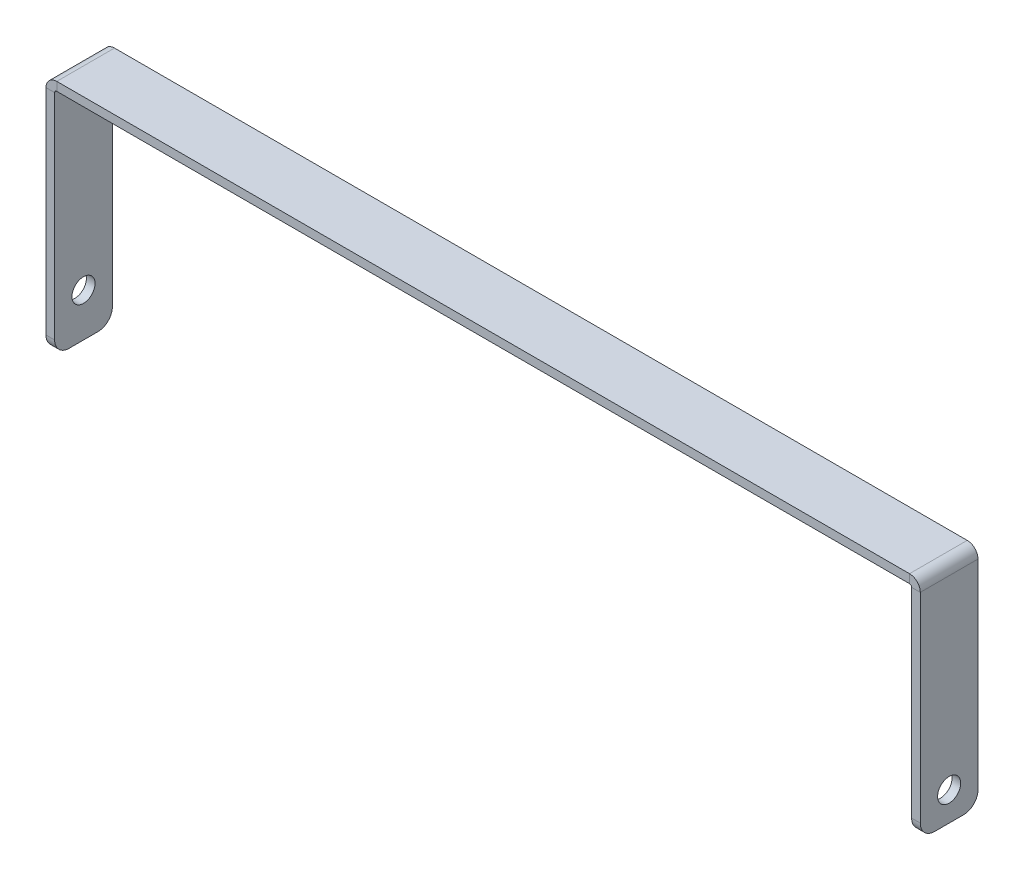
ISO-10303-21;
HEADER;
FILE_DESCRIPTION(('STEP AP214'),'2;1');
FILE_NAME('part.step','',(''),(''),'','','');
FILE_SCHEMA(('AUTOMOTIVE_DESIGN { 1 0 10303 214 1 1 1 1 }'));
ENDSEC;
DATA;
#1=APPLICATION_CONTEXT('core data for automotive mechanical design processes');
#2=APPLICATION_PROTOCOL_DEFINITION('international standard','automotive_design',2000,#1);
#3=PRODUCT_CONTEXT('',#1,'mechanical');
#4=PRODUCT('Part','Part','',(#3));
#5=PRODUCT_RELATED_PRODUCT_CATEGORY('part','',(#4));
#6=PRODUCT_DEFINITION_FORMATION('','',#4);
#7=PRODUCT_DEFINITION_CONTEXT('part definition',#1,'design');
#8=PRODUCT_DEFINITION('design','',#6,#7);
#9=PRODUCT_DEFINITION_SHAPE('','',#8);
#10=(LENGTH_UNIT() NAMED_UNIT(*) SI_UNIT(.MILLI.,.METRE.));
#11=(NAMED_UNIT(*) PLANE_ANGLE_UNIT() SI_UNIT($,.RADIAN.));
#12=(NAMED_UNIT(*) SI_UNIT($,.STERADIAN.) SOLID_ANGLE_UNIT());
#13=UNCERTAINTY_MEASURE_WITH_UNIT(LENGTH_MEASURE(1.E-05),#10,'distance_accuracy_value','');
#14=(GEOMETRIC_REPRESENTATION_CONTEXT(3) GLOBAL_UNCERTAINTY_ASSIGNED_CONTEXT((#13)) GLOBAL_UNIT_ASSIGNED_CONTEXT((#10,
#11,#12)) REPRESENTATION_CONTEXT('',''));
#15=CARTESIAN_POINT('',(0.,0.,0.));
#16=DIRECTION('',(0.,0.,1.));
#17=DIRECTION('',(1.,0.,0.));
#18=AXIS2_PLACEMENT_3D('',#15,#16,#17);
#19=CARTESIAN_POINT('',(-148.5,36.7634,10.));
#20=DIRECTION('',(0.,0.,1.));
#21=DIRECTION('',(1.,0.,0.));
#22=AXIS2_PLACEMENT_3D('',#19,#20,#21);
#23=PLANE('',#22);
#24=DIRECTION('',(-1.,0.,0.));
#25=VECTOR('',#24,1.);
#26=CARTESIAN_POINT('',(-148.5,36.7634,10.));
#27=LINE('',#26,#25);
#28=CARTESIAN_POINT('',(-148.5,36.7634,10.));
#29=VERTEX_POINT('',#28);
#30=CARTESIAN_POINT('',(-151.5,36.7634,10.));
#31=VERTEX_POINT('',#30);
#32=EDGE_CURVE('E273',#29,#31,#27,.T.);
#33=ORIENTED_EDGE('',*,*,#32,.F.);
#34=CARTESIAN_POINT('',(-147.7634,36.7634,10.));
#35=DIRECTION('',(0.,0.,1.));
#36=DIRECTION('',(1.,0.,0.));
#37=AXIS2_PLACEMENT_3D('',#34,#35,#36);
#38=CIRCLE('',#37,0.7366);
#39=CARTESIAN_POINT('',(-147.7634,37.5,10.));
#40=VERTEX_POINT('',#39);
#41=EDGE_CURVE('E202',#29,#40,#38,.F.);
#42=ORIENTED_EDGE('',*,*,#41,.T.);
#43=DIRECTION('',(0.,-1.,0.));
#44=VECTOR('',#43,1.);
#45=CARTESIAN_POINT('',(-147.7634,40.5,10.));
#46=LINE('',#45,#44);
#47=CARTESIAN_POINT('',(-147.7634,40.5,10.));
#48=VERTEX_POINT('',#47);
#49=EDGE_CURVE('E271',#48,#40,#46,.T.);
#50=ORIENTED_EDGE('',*,*,#49,.F.);
#51=CARTESIAN_POINT('',(-147.7634,36.7634,10.));
#52=DIRECTION('',(0.,0.,1.));
#53=DIRECTION('',(1.,0.,0.));
#54=AXIS2_PLACEMENT_3D('',#51,#52,#53);
#55=CIRCLE('',#54,3.7366);
#56=EDGE_CURVE('E192',#31,#48,#55,.F.);
#57=ORIENTED_EDGE('',*,*,#56,.F.);
#58=EDGE_LOOP('',(#33,#42,#50,#57));
#59=FACE_BOUND('',#58,.T.);
#60=ADVANCED_FACE('F36',(#59),#23,.T.);
#61=CARTESIAN_POINT('',(-147.7634,40.5,10.));
#62=DIRECTION('',(0.,0.,1.));
#63=DIRECTION('',(1.,0.,0.));
#64=AXIS2_PLACEMENT_3D('',#61,#62,#63);
#65=PLANE('',#64);
#66=DIRECTION('',(0.,1.,0.));
#67=VECTOR('',#66,1.);
#68=CARTESIAN_POINT('',(-151.5,-42.5,10.));
#69=LINE('',#68,#67);
#70=CARTESIAN_POINT('',(-151.5,-37.5,10.));
#71=VERTEX_POINT('',#70);
#72=EDGE_CURVE('E198',#71,#31,#69,.T.);
#73=ORIENTED_EDGE('',*,*,#72,.F.);
#74=DIRECTION('',(-1.,0.,0.));
#75=VECTOR('',#74,1.);
#76=CARTESIAN_POINT('',(-147.7634,-37.5,10.));
#77=LINE('',#76,#75);
#78=CARTESIAN_POINT('',(-148.5,-37.5,10.));
#79=VERTEX_POINT('',#78);
#80=EDGE_CURVE('E11',#71,#79,#77,.F.);
#81=ORIENTED_EDGE('',*,*,#80,.T.);
#82=DIRECTION('',(0.,1.,0.));
#83=VECTOR('',#82,1.);
#84=CARTESIAN_POINT('',(-148.5,-42.5,10.));
#85=LINE('',#84,#83);
#86=EDGE_CURVE('E200',#79,#29,#85,.T.);
#87=ORIENTED_EDGE('',*,*,#86,.T.);
#88=ORIENTED_EDGE('',*,*,#32,.T.);
#89=EDGE_LOOP('',(#73,#81,#87,#88));
#90=FACE_BOUND('',#89,.T.);
#91=ADVANCED_FACE('F328',(#90),#65,.T.);
#92=CARTESIAN_POINT('',(-147.7634,37.5,-10.));
#93=DIRECTION('',(0.,0.,-1.));
#94=DIRECTION('',(-1.,0.,0.));
#95=AXIS2_PLACEMENT_3D('',#92,#93,#94);
#96=PLANE('',#95);
#97=DIRECTION('',(0.,1.,0.));
#98=VECTOR('',#97,1.);
#99=CARTESIAN_POINT('',(-147.7634,37.5,-10.));
#100=LINE('',#99,#98);
#101=CARTESIAN_POINT('',(-147.7634,37.5,-10.));
#102=VERTEX_POINT('',#101);
#103=CARTESIAN_POINT('',(-147.7634,40.5,-10.));
#104=VERTEX_POINT('',#103);
#105=EDGE_CURVE('E269',#102,#104,#100,.T.);
#106=ORIENTED_EDGE('',*,*,#105,.F.);
#107=CARTESIAN_POINT('',(-147.7634,36.7634,-10.));
#108=DIRECTION('',(0.,0.,1.));
#109=DIRECTION('',(1.,0.,0.));
#110=AXIS2_PLACEMENT_3D('',#107,#108,#109);
#111=CIRCLE('',#110,0.7366);
#112=CARTESIAN_POINT('',(-148.5,36.7634,-10.));
#113=VERTEX_POINT('',#112);
#114=EDGE_CURVE('E227',#113,#102,#111,.F.);
#115=ORIENTED_EDGE('',*,*,#114,.F.);
#116=DIRECTION('',(1.,0.,0.));
#117=VECTOR('',#116,1.);
#118=CARTESIAN_POINT('',(-151.5,36.7634,-10.));
#119=LINE('',#118,#117);
#120=CARTESIAN_POINT('',(-151.5,36.7634,-10.));
#121=VERTEX_POINT('',#120);
#122=EDGE_CURVE('E266',#121,#113,#119,.T.);
#123=ORIENTED_EDGE('',*,*,#122,.F.);
#124=CARTESIAN_POINT('',(-147.7634,36.7634,-10.));
#125=DIRECTION('',(0.,0.,1.));
#126=DIRECTION('',(1.,0.,0.));
#127=AXIS2_PLACEMENT_3D('',#124,#125,#126);
#128=CIRCLE('',#127,3.7366);
#129=EDGE_CURVE('E220',#121,#104,#128,.F.);
#130=ORIENTED_EDGE('',*,*,#129,.T.);
#131=EDGE_LOOP('',(#106,#115,#123,#130));
#132=FACE_BOUND('',#131,.T.);
#133=ADVANCED_FACE('F390',(#132),#96,.T.);
#134=CARTESIAN_POINT('',(-151.5,36.7634,-10.));
#135=DIRECTION('',(0.,0.,-1.));
#136=DIRECTION('',(-1.,0.,0.));
#137=AXIS2_PLACEMENT_3D('',#134,#135,#136);
#138=PLANE('',#137);
#139=DIRECTION('',(1.,0.,0.));
#140=VECTOR('',#139,1.);
#141=CARTESIAN_POINT('',(-148.5,37.5,-10.));
#142=LINE('',#141,#140);
#143=CARTESIAN_POINT('',(147.7634,37.5,-10.));
#144=VERTEX_POINT('',#143);
#145=EDGE_CURVE('E230',#102,#144,#142,.T.);
#146=ORIENTED_EDGE('',*,*,#145,.F.);
#147=ORIENTED_EDGE('',*,*,#105,.T.);
#148=DIRECTION('',(1.,0.,0.));
#149=VECTOR('',#148,1.);
#150=CARTESIAN_POINT('',(-148.5,40.5,-10.));
#151=LINE('',#150,#149);
#152=CARTESIAN_POINT('',(147.7634,40.5,-10.));
#153=VERTEX_POINT('',#152);
#154=EDGE_CURVE('E217',#104,#153,#151,.T.);
#155=ORIENTED_EDGE('',*,*,#154,.T.);
#156=DIRECTION('',(0.,-1.,0.));
#157=VECTOR('',#156,1.);
#158=CARTESIAN_POINT('',(147.7634,40.5,-10.));
#159=LINE('',#158,#157);
#160=EDGE_CURVE('E262',#153,#144,#159,.T.);
#161=ORIENTED_EDGE('',*,*,#160,.T.);
#162=EDGE_LOOP('',(#146,#147,#155,#161));
#163=FACE_BOUND('',#162,.T.);
#164=ADVANCED_FACE('F611',(#163),#138,.T.);
#165=CARTESIAN_POINT('',(147.7634,37.5,10.));
#166=DIRECTION('',(0.,0.,1.));
#167=DIRECTION('',(1.,0.,0.));
#168=AXIS2_PLACEMENT_3D('',#165,#166,#167);
#169=PLANE('',#168);
#170=DIRECTION('',(0.,1.,0.));
#171=VECTOR('',#170,1.);
#172=CARTESIAN_POINT('',(147.7634,37.5,10.));
#173=LINE('',#172,#171);
#174=CARTESIAN_POINT('',(147.7634,37.5,10.));
#175=VERTEX_POINT('',#174);
#176=CARTESIAN_POINT('',(147.7634,40.5,10.));
#177=VERTEX_POINT('',#176);
#178=EDGE_CURVE('E162',#175,#177,#173,.T.);
#179=ORIENTED_EDGE('',*,*,#178,.F.);
#180=CARTESIAN_POINT('',(147.7634,36.7634,10.));
#181=DIRECTION('',(0.,0.,1.));
#182=DIRECTION('',(1.,0.,0.));
#183=AXIS2_PLACEMENT_3D('',#180,#181,#182);
#184=CIRCLE('',#183,0.7366);
#185=CARTESIAN_POINT('',(148.5,36.7634,10.));
#186=VERTEX_POINT('',#185);
#187=EDGE_CURVE('E157',#175,#186,#184,.F.);
#188=ORIENTED_EDGE('',*,*,#187,.T.);
#189=DIRECTION('',(-1.,0.,0.));
#190=VECTOR('',#189,1.);
#191=CARTESIAN_POINT('',(151.5,36.7634,10.));
#192=LINE('',#191,#190);
#193=CARTESIAN_POINT('',(151.5,36.7634,10.));
#194=VERTEX_POINT('',#193);
#195=EDGE_CURVE('E150',#194,#186,#192,.T.);
#196=ORIENTED_EDGE('',*,*,#195,.F.);
#197=CARTESIAN_POINT('',(147.7634,36.7634,10.));
#198=DIRECTION('',(0.,0.,1.));
#199=DIRECTION('',(1.,0.,0.));
#200=AXIS2_PLACEMENT_3D('',#197,#198,#199);
#201=CIRCLE('',#200,3.7366);
#202=EDGE_CURVE('E154',#177,#194,#201,.F.);
#203=ORIENTED_EDGE('',*,*,#202,.F.);
#204=EDGE_LOOP('',(#179,#188,#196,#203));
#205=FACE_BOUND('',#204,.T.);
#206=ADVANCED_FACE('F152',(#205),#169,.T.);
#207=CARTESIAN_POINT('',(151.5,36.7634,10.));
#208=DIRECTION('',(0.,0.,1.));
#209=DIRECTION('',(1.,0.,0.));
#210=AXIS2_PLACEMENT_3D('',#207,#208,#209);
#211=PLANE('',#210);
#212=DIRECTION('',(1.,0.,0.));
#213=VECTOR('',#212,1.);
#214=CARTESIAN_POINT('',(-148.5,37.5,10.));
#215=LINE('',#214,#213);
#216=EDGE_CURVE('E205',#40,#175,#215,.T.);
#217=ORIENTED_EDGE('',*,*,#216,.T.);
#218=ORIENTED_EDGE('',*,*,#178,.T.);
#219=DIRECTION('',(1.,0.,0.));
#220=VECTOR('',#219,1.);
#221=CARTESIAN_POINT('',(-148.5,40.5,10.));
#222=LINE('',#221,#220);
#223=EDGE_CURVE('E190',#48,#177,#222,.T.);
#224=ORIENTED_EDGE('',*,*,#223,.F.);
#225=ORIENTED_EDGE('',*,*,#49,.T.);
#226=EDGE_LOOP('',(#217,#218,#224,#225));
#227=FACE_BOUND('',#226,.T.);
#228=ADVANCED_FACE('F344',(#227),#211,.T.);
#229=CARTESIAN_POINT('',(148.5,36.7634,-10.));
#230=DIRECTION('',(0.,0.,-1.));
#231=DIRECTION('',(-1.,0.,0.));
#232=AXIS2_PLACEMENT_3D('',#229,#230,#231);
#233=PLANE('',#232);
#234=DIRECTION('',(1.,0.,0.));
#235=VECTOR('',#234,1.);
#236=CARTESIAN_POINT('',(148.5,36.7634,-10.));
#237=LINE('',#236,#235);
#238=CARTESIAN_POINT('',(148.5,36.7634,-10.));
#239=VERTEX_POINT('',#238);
#240=CARTESIAN_POINT('',(151.5,36.7634,-10.));
#241=VERTEX_POINT('',#240);
#242=EDGE_CURVE('E163',#239,#241,#237,.T.);
#243=ORIENTED_EDGE('',*,*,#242,.F.);
#244=CARTESIAN_POINT('',(147.7634,36.7634,-10.));
#245=DIRECTION('',(0.,0.,1.));
#246=DIRECTION('',(1.,0.,0.));
#247=AXIS2_PLACEMENT_3D('',#244,#245,#246);
#248=CIRCLE('',#247,0.7366);
#249=EDGE_CURVE('E233',#144,#239,#248,.F.);
#250=ORIENTED_EDGE('',*,*,#249,.F.);
#251=ORIENTED_EDGE('',*,*,#160,.F.);
#252=CARTESIAN_POINT('',(147.7634,36.7634,-10.));
#253=DIRECTION('',(0.,0.,1.));
#254=DIRECTION('',(1.,0.,0.));
#255=AXIS2_PLACEMENT_3D('',#252,#253,#254);
#256=CIRCLE('',#255,3.7366);
#257=EDGE_CURVE('E215',#153,#241,#256,.F.);
#258=ORIENTED_EDGE('',*,*,#257,.T.);
#259=EDGE_LOOP('',(#243,#250,#251,#258));
#260=FACE_BOUND('',#259,.T.);
#261=ADVANCED_FACE('F513',(#260),#233,.T.);
#262=CARTESIAN_POINT('',(147.7634,40.5,-10.));
#263=DIRECTION('',(0.,0.,-1.));
#264=DIRECTION('',(-1.,0.,0.));
#265=AXIS2_PLACEMENT_3D('',#262,#263,#264);
#266=PLANE('',#265);
#267=DIRECTION('',(0.,-1.,0.));
#268=VECTOR('',#267,1.);
#269=CARTESIAN_POINT('',(151.5,37.5,-10.));
#270=LINE('',#269,#268);
#271=CARTESIAN_POINT('',(151.5,-32.5,-10.));
#272=VERTEX_POINT('',#271);
#273=EDGE_CURVE('E175',#241,#272,#270,.T.);
#274=ORIENTED_EDGE('',*,*,#273,.T.);
#275=DIRECTION('',(-1.,0.,0.));
#276=VECTOR('',#275,1.);
#277=CARTESIAN_POINT('',(147.7634,-32.5,-10.));
#278=LINE('',#277,#276);
#279=CARTESIAN_POINT('',(148.5,-32.5,-10.));
#280=VERTEX_POINT('',#279);
#281=EDGE_CURVE('E276',#272,#280,#278,.T.);
#282=ORIENTED_EDGE('',*,*,#281,.T.);
#283=DIRECTION('',(0.,-1.,0.));
#284=VECTOR('',#283,1.);
#285=CARTESIAN_POINT('',(148.5,37.5,-10.));
#286=LINE('',#285,#284);
#287=EDGE_CURVE('E210',#239,#280,#286,.T.);
#288=ORIENTED_EDGE('',*,*,#287,.F.);
#289=ORIENTED_EDGE('',*,*,#242,.T.);
#290=EDGE_LOOP('',(#274,#282,#288,#289));
#291=FACE_BOUND('',#290,.T.);
#292=ADVANCED_FACE('F502',(#291),#266,.T.);
#293=CARTESIAN_POINT('',(148.5,37.5,10.));
#294=DIRECTION('',(1.,0.,0.));
#295=DIRECTION('',(0.,1.,0.));
#296=AXIS2_PLACEMENT_3D('',#293,#294,#295);
#297=PLANE('',#296);
#298=CARTESIAN_POINT('',(148.5,-27.5000000000001,0.));
#299=DIRECTION('',(1.,0.,0.));
#300=DIRECTION('',(0.,1.,0.));
#301=AXIS2_PLACEMENT_3D('',#298,#299,#300);
#302=CIRCLE('',#301,4.);
#303=CARTESIAN_POINT('',(148.5,-23.5000000000001,0.));
#304=VERTEX_POINT('',#303);
#305=EDGE_CURVE('E213',#304,#304,#302,.T.);
#306=ORIENTED_EDGE('',*,*,#305,.T.);
#307=EDGE_LOOP('',(#306));
#308=FACE_BOUND('',#307,.T.);
#309=ORIENTED_EDGE('',*,*,#287,.T.);
#310=CARTESIAN_POINT('',(148.5,-32.5,-5.));
#311=DIRECTION('',(1.,0.,0.));
#312=DIRECTION('',(0.,1.,0.));
#313=AXIS2_PLACEMENT_3D('',#310,#311,#312);
#314=CIRCLE('',#313,5.);
#315=CARTESIAN_POINT('',(148.5,-37.5,-5.));
#316=VERTEX_POINT('',#315);
#317=EDGE_CURVE('E285',#280,#316,#314,.F.);
#318=ORIENTED_EDGE('',*,*,#317,.T.);
#319=DIRECTION('',(0.,0.,-1.));
#320=VECTOR('',#319,1.);
#321=CARTESIAN_POINT('',(148.5,-37.5,10.));
#322=LINE('',#321,#320);
#323=CARTESIAN_POINT('',(148.5,-37.5,5.));
#324=VERTEX_POINT('',#323);
#325=EDGE_CURVE('E259',#324,#316,#322,.T.);
#326=ORIENTED_EDGE('',*,*,#325,.F.);
#327=CARTESIAN_POINT('',(148.5,-32.5,5.));
#328=DIRECTION('',(1.,0.,0.));
#329=DIRECTION('',(0.,1.,0.));
#330=AXIS2_PLACEMENT_3D('',#327,#328,#329);
#331=CIRCLE('',#330,5.);
#332=CARTESIAN_POINT('',(148.5,-32.5,10.));
#333=VERTEX_POINT('',#332);
#334=EDGE_CURVE('E283',#324,#333,#331,.F.);
#335=ORIENTED_EDGE('',*,*,#334,.T.);
#336=DIRECTION('',(0.,-1.,0.));
#337=VECTOR('',#336,1.);
#338=CARTESIAN_POINT('',(148.5,37.5,10.));
#339=LINE('',#338,#337);
#340=EDGE_CURVE('E185',#186,#333,#339,.T.);
#341=ORIENTED_EDGE('',*,*,#340,.F.);
#342=DIRECTION('',(0.,0.,-1.));
#343=VECTOR('',#342,1.);
#344=CARTESIAN_POINT('',(148.5,36.7634,10.));
#345=LINE('',#344,#343);
#346=EDGE_CURVE('E209',#186,#239,#345,.T.);
#347=ORIENTED_EDGE('',*,*,#346,.T.);
#348=EDGE_LOOP('',(#309,#318,#326,#335,#341,#347));
#349=FACE_BOUND('',#348,.T.);
#350=ADVANCED_FACE('F356',(#308,#349),#297,.F.);
#351=CARTESIAN_POINT('',(151.5,-37.5,10.));
#352=DIRECTION('',(0.,-1.,0.));
#353=DIRECTION('',(0.,0.,-1.));
#354=AXIS2_PLACEMENT_3D('',#351,#352,#353);
#355=PLANE('',#354);
#356=ORIENTED_EDGE('',*,*,#325,.T.);
#357=DIRECTION('',(-1.,0.,0.));
#358=VECTOR('',#357,1.);
#359=CARTESIAN_POINT('',(151.5,-37.5,-5.));
#360=LINE('',#359,#358);
#361=CARTESIAN_POINT('',(151.5,-37.5,-5.));
#362=VERTEX_POINT('',#361);
#363=EDGE_CURVE('E290',#316,#362,#360,.F.);
#364=ORIENTED_EDGE('',*,*,#363,.T.);
#365=DIRECTION('',(0.,0.,-1.));
#366=VECTOR('',#365,1.);
#367=CARTESIAN_POINT('',(151.5,-37.5,10.));
#368=LINE('',#367,#366);
#369=CARTESIAN_POINT('',(151.5,-37.5,5.));
#370=VERTEX_POINT('',#369);
#371=EDGE_CURVE('E179',#370,#362,#368,.T.);
#372=ORIENTED_EDGE('',*,*,#371,.F.);
#373=DIRECTION('',(-1.,0.,0.));
#374=VECTOR('',#373,1.);
#375=CARTESIAN_POINT('',(151.5,-37.5,5.));
#376=LINE('',#375,#374);
#377=EDGE_CURVE('E287',#370,#324,#376,.T.);
#378=ORIENTED_EDGE('',*,*,#377,.T.);
#379=EDGE_LOOP('',(#356,#364,#372,#378));
#380=FACE_BOUND('',#379,.T.);
#381=ADVANCED_FACE('F479',(#380),#355,.T.);
#382=CARTESIAN_POINT('',(151.5,37.5,10.));
#383=DIRECTION('',(1.,0.,0.));
#384=DIRECTION('',(0.,1.,0.));
#385=AXIS2_PLACEMENT_3D('',#382,#383,#384);
#386=PLANE('',#385);
#387=CARTESIAN_POINT('',(151.5,-27.5000000000001,0.));
#388=DIRECTION('',(1.,0.,0.));
#389=DIRECTION('',(0.,1.,0.));
#390=AXIS2_PLACEMENT_3D('',#387,#388,#389);
#391=CIRCLE('',#390,4.);
#392=CARTESIAN_POINT('',(151.5,-23.5000000000001,0.));
#393=VERTEX_POINT('',#392);
#394=EDGE_CURVE('E361',#393,#393,#391,.T.);
#395=ORIENTED_EDGE('',*,*,#394,.F.);
#396=EDGE_LOOP('',(#395));
#397=FACE_BOUND('',#396,.T.);
#398=ORIENTED_EDGE('',*,*,#371,.T.);
#399=CARTESIAN_POINT('',(151.5,-32.5,-5.));
#400=DIRECTION('',(1.,0.,0.));
#401=DIRECTION('',(0.,1.,0.));
#402=AXIS2_PLACEMENT_3D('',#399,#400,#401);
#403=CIRCLE('',#402,5.);
#404=EDGE_CURVE('E294',#362,#272,#403,.T.);
#405=ORIENTED_EDGE('',*,*,#404,.T.);
#406=ORIENTED_EDGE('',*,*,#273,.F.);
#407=DIRECTION('',(0.,0.,-1.));
#408=VECTOR('',#407,1.);
#409=CARTESIAN_POINT('',(151.5,36.7634,10.));
#410=LINE('',#409,#408);
#411=EDGE_CURVE('E169',#194,#241,#410,.T.);
#412=ORIENTED_EDGE('',*,*,#411,.F.);
#413=DIRECTION('',(0.,-1.,0.));
#414=VECTOR('',#413,1.);
#415=CARTESIAN_POINT('',(151.5,37.5,10.));
#416=LINE('',#415,#414);
#417=CARTESIAN_POINT('',(151.5,-32.5,10.));
#418=VERTEX_POINT('',#417);
#419=EDGE_CURVE('E172',#194,#418,#416,.T.);
#420=ORIENTED_EDGE('',*,*,#419,.T.);
#421=CARTESIAN_POINT('',(151.5,-32.5,5.));
#422=DIRECTION('',(1.,0.,0.));
#423=DIRECTION('',(0.,1.,0.));
#424=AXIS2_PLACEMENT_3D('',#421,#422,#423);
#425=CIRCLE('',#424,5.);
#426=EDGE_CURVE('E292',#418,#370,#425,.T.);
#427=ORIENTED_EDGE('',*,*,#426,.T.);
#428=EDGE_LOOP('',(#398,#405,#406,#412,#420,#427));
#429=FACE_BOUND('',#428,.T.);
#430=ADVANCED_FACE('F171',(#397,#429),#386,.T.);
#431=CARTESIAN_POINT('',(147.7634,36.7634,10.));
#432=DIRECTION('',(0.,0.,-1.));
#433=DIRECTION('',(-1.,0.,0.));
#434=AXIS2_PLACEMENT_3D('',#431,#432,#433);
#435=CYLINDRICAL_SURFACE('',#434,3.7366);
#436=ORIENTED_EDGE('',*,*,#257,.F.);
#437=DIRECTION('',(0.,0.,-1.));
#438=VECTOR('',#437,1.);
#439=CARTESIAN_POINT('',(147.7634,40.5,10.));
#440=LINE('',#439,#438);
#441=EDGE_CURVE('E180',#177,#153,#440,.T.);
#442=ORIENTED_EDGE('',*,*,#441,.F.);
#443=ORIENTED_EDGE('',*,*,#202,.T.);
#444=ORIENTED_EDGE('',*,*,#411,.T.);
#445=EDGE_LOOP('',(#436,#442,#443,#444));
#446=FACE_BOUND('',#445,.T.);
#447=ADVANCED_FACE('F188',(#446),#435,.T.);
#448=CARTESIAN_POINT('',(-148.5,40.5,10.));
#449=DIRECTION('',(0.,1.,0.));
#450=DIRECTION('',(0.,0.,1.));
#451=AXIS2_PLACEMENT_3D('',#448,#449,#450);
#452=PLANE('',#451);
#453=ORIENTED_EDGE('',*,*,#154,.F.);
#454=DIRECTION('',(0.,0.,-1.));
#455=VECTOR('',#454,1.);
#456=CARTESIAN_POINT('',(-147.7634,40.5,10.));
#457=LINE('',#456,#455);
#458=EDGE_CURVE('E254',#48,#104,#457,.T.);
#459=ORIENTED_EDGE('',*,*,#458,.F.);
#460=ORIENTED_EDGE('',*,*,#223,.T.);
#461=ORIENTED_EDGE('',*,*,#441,.T.);
#462=EDGE_LOOP('',(#453,#459,#460,#461));
#463=FACE_BOUND('',#462,.T.);
#464=ADVANCED_FACE('F343',(#463),#452,.T.);
#465=CARTESIAN_POINT('',(-147.7634,36.7634,10.));
#466=DIRECTION('',(0.,0.,-1.));
#467=DIRECTION('',(-1.,0.,0.));
#468=AXIS2_PLACEMENT_3D('',#465,#466,#467);
#469=CYLINDRICAL_SURFACE('',#468,3.7366);
#470=ORIENTED_EDGE('',*,*,#129,.F.);
#471=DIRECTION('',(0.,0.,-1.));
#472=VECTOR('',#471,1.);
#473=CARTESIAN_POINT('',(-151.5,36.7634,10.));
#474=LINE('',#473,#472);
#475=EDGE_CURVE('E251',#31,#121,#474,.T.);
#476=ORIENTED_EDGE('',*,*,#475,.F.);
#477=ORIENTED_EDGE('',*,*,#56,.T.);
#478=ORIENTED_EDGE('',*,*,#458,.T.);
#479=EDGE_LOOP('',(#470,#476,#477,#478));
#480=FACE_BOUND('',#479,.T.);
#481=ADVANCED_FACE('F335',(#480),#469,.T.);
#482=CARTESIAN_POINT('',(-151.5,-42.5,10.));
#483=DIRECTION('',(-1.,0.,0.));
#484=DIRECTION('',(0.,0.,1.));
#485=AXIS2_PLACEMENT_3D('',#482,#483,#484);
#486=PLANE('',#485);
#487=CARTESIAN_POINT('',(-151.5,-27.5000000000002,0.));
#488=DIRECTION('',(1.,0.,0.));
#489=DIRECTION('',(0.,1.,0.));
#490=AXIS2_PLACEMENT_3D('',#487,#488,#489);
#491=CIRCLE('',#490,4.);
#492=CARTESIAN_POINT('',(-151.5,-23.5000000000002,0.));
#493=VERTEX_POINT('',#492);
#494=EDGE_CURVE('E280',#493,#493,#491,.T.);
#495=ORIENTED_EDGE('',*,*,#494,.T.);
#496=EDGE_LOOP('',(#495));
#497=FACE_BOUND('',#496,.T.);
#498=DIRECTION('',(0.,1.,0.));
#499=VECTOR('',#498,1.);
#500=CARTESIAN_POINT('',(-151.5,-42.5,-10.));
#501=LINE('',#500,#499);
#502=CARTESIAN_POINT('',(-151.5,-37.5,-10.));
#503=VERTEX_POINT('',#502);
#504=EDGE_CURVE('E223',#503,#121,#501,.T.);
#505=ORIENTED_EDGE('',*,*,#504,.F.);
#506=CARTESIAN_POINT('',(-151.5,-37.5,-5.));
#507=DIRECTION('',(-1.,0.,0.));
#508=DIRECTION('',(0.,0.,1.));
#509=AXIS2_PLACEMENT_3D('',#506,#507,#508);
#510=CIRCLE('',#509,5.);
#511=CARTESIAN_POINT('',(-151.5,-42.5,-5.));
#512=VERTEX_POINT('',#511);
#513=EDGE_CURVE('E302',#503,#512,#510,.T.);
#514=ORIENTED_EDGE('',*,*,#513,.T.);
#515=DIRECTION('',(0.,0.,-1.));
#516=VECTOR('',#515,1.);
#517=CARTESIAN_POINT('',(-151.5,-42.5,10.));
#518=LINE('',#517,#516);
#519=CARTESIAN_POINT('',(-151.5,-42.5,5.));
#520=VERTEX_POINT('',#519);
#521=EDGE_CURVE('E249',#520,#512,#518,.T.);
#522=ORIENTED_EDGE('',*,*,#521,.F.);
#523=CARTESIAN_POINT('',(-151.5,-37.5,5.));
#524=DIRECTION('',(-1.,0.,0.));
#525=DIRECTION('',(0.,0.,1.));
#526=AXIS2_PLACEMENT_3D('',#523,#524,#525);
#527=CIRCLE('',#526,5.);
#528=EDGE_CURVE('E300',#520,#71,#527,.T.);
#529=ORIENTED_EDGE('',*,*,#528,.T.);
#530=ORIENTED_EDGE('',*,*,#72,.T.);
#531=ORIENTED_EDGE('',*,*,#475,.T.);
#532=EDGE_LOOP('',(#505,#514,#522,#529,#530,#531));
#533=FACE_BOUND('',#532,.T.);
#534=ADVANCED_FACE('F323',(#497,#533),#486,.T.);
#535=CARTESIAN_POINT('',(-148.5,-42.5,10.));
#536=DIRECTION('',(0.,-1.,0.));
#537=DIRECTION('',(0.,0.,-1.));
#538=AXIS2_PLACEMENT_3D('',#535,#536,#537);
#539=PLANE('',#538);
#540=ORIENTED_EDGE('',*,*,#521,.T.);
#541=DIRECTION('',(-1.,0.,0.));
#542=VECTOR('',#541,1.);
#543=CARTESIAN_POINT('',(-148.5,-42.5,-5.));
#544=LINE('',#543,#542);
#545=CARTESIAN_POINT('',(-148.5,-42.5,-5.));
#546=VERTEX_POINT('',#545);
#547=EDGE_CURVE('E57',#512,#546,#544,.F.);
#548=ORIENTED_EDGE('',*,*,#547,.T.);
#549=DIRECTION('',(0.,0.,-1.));
#550=VECTOR('',#549,1.);
#551=CARTESIAN_POINT('',(-148.5,-42.5,10.));
#552=LINE('',#551,#550);
#553=CARTESIAN_POINT('',(-148.5,-42.5,5.));
#554=VERTEX_POINT('',#553);
#555=EDGE_CURVE('E247',#554,#546,#552,.T.);
#556=ORIENTED_EDGE('',*,*,#555,.F.);
#557=DIRECTION('',(-1.,0.,0.));
#558=VECTOR('',#557,1.);
#559=CARTESIAN_POINT('',(-148.5,-42.5,5.));
#560=LINE('',#559,#558);
#561=EDGE_CURVE('E304',#554,#520,#560,.T.);
#562=ORIENTED_EDGE('',*,*,#561,.T.);
#563=EDGE_LOOP('',(#540,#548,#556,#562));
#564=FACE_BOUND('',#563,.T.);
#565=ADVANCED_FACE('F324',(#564),#539,.T.);
#566=CARTESIAN_POINT('',(-148.5,-42.5,10.));
#567=DIRECTION('',(-1.,0.,0.));
#568=DIRECTION('',(0.,0.,1.));
#569=AXIS2_PLACEMENT_3D('',#566,#567,#568);
#570=PLANE('',#569);
#571=CARTESIAN_POINT('',(-148.5,-27.5000000000002,0.));
#572=DIRECTION('',(-1.,0.,0.));
#573=DIRECTION('',(0.,0.,1.));
#574=AXIS2_PLACEMENT_3D('',#571,#572,#573);
#575=CIRCLE('',#574,4.);
#576=CARTESIAN_POINT('',(-148.5,-27.5000000000002,4.));
#577=VERTEX_POINT('',#576);
#578=EDGE_CURVE('E277',#577,#577,#575,.T.);
#579=ORIENTED_EDGE('',*,*,#578,.T.);
#580=EDGE_LOOP('',(#579));
#581=FACE_BOUND('',#580,.T.);
#582=ORIENTED_EDGE('',*,*,#555,.T.);
#583=CARTESIAN_POINT('',(-148.5,-37.5,-5.));
#584=DIRECTION('',(-1.,0.,0.));
#585=DIRECTION('',(0.,0.,1.));
#586=AXIS2_PLACEMENT_3D('',#583,#584,#585);
#587=CIRCLE('',#586,5.);
#588=CARTESIAN_POINT('',(-148.5,-37.5,-10.));
#589=VERTEX_POINT('',#588);
#590=EDGE_CURVE('E44',#546,#589,#587,.F.);
#591=ORIENTED_EDGE('',*,*,#590,.T.);
#592=DIRECTION('',(0.,1.,0.));
#593=VECTOR('',#592,1.);
#594=CARTESIAN_POINT('',(-148.5,-42.5,-10.));
#595=LINE('',#594,#593);
#596=EDGE_CURVE('E225',#589,#113,#595,.T.);
#597=ORIENTED_EDGE('',*,*,#596,.T.);
#598=DIRECTION('',(0.,0.,-1.));
#599=VECTOR('',#598,1.);
#600=CARTESIAN_POINT('',(-148.5,36.7634,10.));
#601=LINE('',#600,#599);
#602=EDGE_CURVE('E244',#29,#113,#601,.T.);
#603=ORIENTED_EDGE('',*,*,#602,.F.);
#604=ORIENTED_EDGE('',*,*,#86,.F.);
#605=CARTESIAN_POINT('',(-148.5,-37.5,5.));
#606=DIRECTION('',(-1.,0.,0.));
#607=DIRECTION('',(0.,0.,1.));
#608=AXIS2_PLACEMENT_3D('',#605,#606,#607);
#609=CIRCLE('',#608,5.);
#610=EDGE_CURVE('E308',#79,#554,#609,.F.);
#611=ORIENTED_EDGE('',*,*,#610,.T.);
#612=EDGE_LOOP('',(#582,#591,#597,#603,#604,#611));
#613=FACE_BOUND('',#612,.T.);
#614=ADVANCED_FACE('F312',(#581,#613),#570,.F.);
#615=CARTESIAN_POINT('',(-147.7634,36.7634,10.));
#616=DIRECTION('',(0.,0.,-1.));
#617=DIRECTION('',(-1.,0.,0.));
#618=AXIS2_PLACEMENT_3D('',#615,#616,#617);
#619=CYLINDRICAL_SURFACE('',#618,0.7366);
#620=ORIENTED_EDGE('',*,*,#114,.T.);
#621=DIRECTION('',(0.,0.,-1.));
#622=VECTOR('',#621,1.);
#623=CARTESIAN_POINT('',(-147.7634,37.5,10.));
#624=LINE('',#623,#622);
#625=EDGE_CURVE('E241',#40,#102,#624,.T.);
#626=ORIENTED_EDGE('',*,*,#625,.F.);
#627=ORIENTED_EDGE('',*,*,#41,.F.);
#628=ORIENTED_EDGE('',*,*,#602,.T.);
#629=EDGE_LOOP('',(#620,#626,#627,#628));
#630=FACE_BOUND('',#629,.T.);
#631=ADVANCED_FACE('F376',(#630),#619,.F.);
#632=CARTESIAN_POINT('',(-148.5,37.5,10.));
#633=DIRECTION('',(0.,1.,0.));
#634=DIRECTION('',(0.,0.,1.));
#635=AXIS2_PLACEMENT_3D('',#632,#633,#634);
#636=PLANE('',#635);
#637=ORIENTED_EDGE('',*,*,#145,.T.);
#638=DIRECTION('',(0.,0.,-1.));
#639=VECTOR('',#638,1.);
#640=CARTESIAN_POINT('',(147.7634,37.5,10.));
#641=LINE('',#640,#639);
#642=EDGE_CURVE('E238',#175,#144,#641,.T.);
#643=ORIENTED_EDGE('',*,*,#642,.F.);
#644=ORIENTED_EDGE('',*,*,#216,.F.);
#645=ORIENTED_EDGE('',*,*,#625,.T.);
#646=EDGE_LOOP('',(#637,#643,#644,#645));
#647=FACE_BOUND('',#646,.T.);
#648=ADVANCED_FACE('F348',(#647),#636,.F.);
#649=CARTESIAN_POINT('',(147.7634,36.7634,10.));
#650=DIRECTION('',(0.,0.,-1.));
#651=DIRECTION('',(-1.,0.,0.));
#652=AXIS2_PLACEMENT_3D('',#649,#650,#651);
#653=CYLINDRICAL_SURFACE('',#652,0.7366);
#654=ORIENTED_EDGE('',*,*,#249,.T.);
#655=ORIENTED_EDGE('',*,*,#346,.F.);
#656=ORIENTED_EDGE('',*,*,#187,.F.);
#657=ORIENTED_EDGE('',*,*,#642,.T.);
#658=EDGE_LOOP('',(#654,#655,#656,#657));
#659=FACE_BOUND('',#658,.T.);
#660=ADVANCED_FACE('F352',(#659),#653,.F.);
#661=CARTESIAN_POINT('',(147.7634,36.7634,10.));
#662=DIRECTION('',(0.,0.,1.));
#663=DIRECTION('',(1.,0.,0.));
#664=AXIS2_PLACEMENT_3D('',#661,#662,#663);
#665=PLANE('',#664);
#666=ORIENTED_EDGE('',*,*,#340,.T.);
#667=DIRECTION('',(-1.,0.,0.));
#668=VECTOR('',#667,1.);
#669=CARTESIAN_POINT('',(147.7634,-32.5,10.));
#670=LINE('',#669,#668);
#671=EDGE_CURVE('E184',#333,#418,#670,.F.);
#672=ORIENTED_EDGE('',*,*,#671,.T.);
#673=ORIENTED_EDGE('',*,*,#419,.F.);
#674=ORIENTED_EDGE('',*,*,#195,.T.);
#675=EDGE_LOOP('',(#666,#672,#673,#674));
#676=FACE_BOUND('',#675,.T.);
#677=ADVANCED_FACE('F182',(#676),#665,.T.);
#678=CARTESIAN_POINT('',(147.7634,36.7634,-10.));
#679=DIRECTION('',(0.,0.,1.));
#680=DIRECTION('',(1.,0.,0.));
#681=AXIS2_PLACEMENT_3D('',#678,#679,#680);
#682=PLANE('',#681);
#683=ORIENTED_EDGE('',*,*,#596,.F.);
#684=DIRECTION('',(-1.,0.,0.));
#685=VECTOR('',#684,1.);
#686=CARTESIAN_POINT('',(-151.5,-37.5,-10.));
#687=LINE('',#686,#685);
#688=EDGE_CURVE('E297',#589,#503,#687,.T.);
#689=ORIENTED_EDGE('',*,*,#688,.T.);
#690=ORIENTED_EDGE('',*,*,#504,.T.);
#691=ORIENTED_EDGE('',*,*,#122,.T.);
#692=EDGE_LOOP('',(#683,#689,#690,#691));
#693=FACE_BOUND('',#692,.T.);
#694=ADVANCED_FACE('F317',(#693),#682,.F.);
#695=CARTESIAN_POINT('',(-151.5,-27.5000000000002,0.));
#696=DIRECTION('',(1.,0.,0.));
#697=DIRECTION('',(0.,1.,0.));
#698=AXIS2_PLACEMENT_3D('',#695,#696,#697);
#699=CYLINDRICAL_SURFACE('',#698,4.);
#700=ORIENTED_EDGE('',*,*,#494,.F.);
#701=EDGE_LOOP('',(#700));
#702=FACE_BOUND('',#701,.T.);
#703=ORIENTED_EDGE('',*,*,#578,.F.);
#704=EDGE_LOOP('',(#703));
#705=FACE_BOUND('',#704,.T.);
#706=ADVANCED_FACE('F368',(#702,#705),#699,.F.);
#707=ORIENTED_EDGE('',*,*,#394,.T.);
#708=EDGE_LOOP('',(#707));
#709=FACE_BOUND('',#708,.T.);
#710=ORIENTED_EDGE('',*,*,#305,.F.);
#711=EDGE_LOOP('',(#710));
#712=FACE_BOUND('',#711,.T.);
#713=ADVANCED_FACE('F371',(#709,#712),#699,.F.);
#714=CARTESIAN_POINT('',(147.7634,-32.5,-5.));
#715=DIRECTION('',(-1.,0.,0.));
#716=DIRECTION('',(0.,0.,1.));
#717=AXIS2_PLACEMENT_3D('',#714,#715,#716);
#718=CYLINDRICAL_SURFACE('',#717,5.);
#719=ORIENTED_EDGE('',*,*,#404,.F.);
#720=ORIENTED_EDGE('',*,*,#363,.F.);
#721=ORIENTED_EDGE('',*,*,#317,.F.);
#722=ORIENTED_EDGE('',*,*,#281,.F.);
#723=EDGE_LOOP('',(#719,#720,#721,#722));
#724=FACE_BOUND('',#723,.T.);
#725=ADVANCED_FACE('F394',(#724),#718,.T.);
#726=CARTESIAN_POINT('',(151.5,-32.5,5.));
#727=DIRECTION('',(-1.,0.,0.));
#728=DIRECTION('',(0.,0.,1.));
#729=AXIS2_PLACEMENT_3D('',#726,#727,#728);
#730=CYLINDRICAL_SURFACE('',#729,5.);
#731=ORIENTED_EDGE('',*,*,#426,.F.);
#732=ORIENTED_EDGE('',*,*,#671,.F.);
#733=ORIENTED_EDGE('',*,*,#334,.F.);
#734=ORIENTED_EDGE('',*,*,#377,.F.);
#735=EDGE_LOOP('',(#731,#732,#733,#734));
#736=FACE_BOUND('',#735,.T.);
#737=ADVANCED_FACE('F397',(#736),#730,.T.);
#738=CARTESIAN_POINT('',(147.7634,-37.5,-5.));
#739=DIRECTION('',(1.,0.,0.));
#740=DIRECTION('',(0.,0.,-1.));
#741=AXIS2_PLACEMENT_3D('',#738,#739,#740);
#742=CYLINDRICAL_SURFACE('',#741,5.);
#743=ORIENTED_EDGE('',*,*,#590,.F.);
#744=ORIENTED_EDGE('',*,*,#547,.F.);
#745=ORIENTED_EDGE('',*,*,#513,.F.);
#746=ORIENTED_EDGE('',*,*,#688,.F.);
#747=EDGE_LOOP('',(#743,#744,#745,#746));
#748=FACE_BOUND('',#747,.T.);
#749=ADVANCED_FACE('F320',(#748),#742,.T.);
#750=CARTESIAN_POINT('',(-148.5,-37.5,5.));
#751=DIRECTION('',(-1.,0.,0.));
#752=DIRECTION('',(0.,0.,1.));
#753=AXIS2_PLACEMENT_3D('',#750,#751,#752);
#754=CYLINDRICAL_SURFACE('',#753,5.);
#755=ORIENTED_EDGE('',*,*,#610,.F.);
#756=ORIENTED_EDGE('',*,*,#80,.F.);
#757=ORIENTED_EDGE('',*,*,#528,.F.);
#758=ORIENTED_EDGE('',*,*,#561,.F.);
#759=EDGE_LOOP('',(#755,#756,#757,#758));
#760=FACE_BOUND('',#759,.T.);
#761=ADVANCED_FACE('F38',(#760),#754,.T.);
#762=CLOSED_SHELL('',(#60,#91,#133,#164,#206,#228,#261,#292,#350,#381,#430,#447,#464,#481,#534,
#565,#614,#631,#648,#660,#677,#694,#706,#713,#725,#737,#749,#761));
#763=MANIFOLD_SOLID_BREP('B2',#762);
#764=ADVANCED_BREP_SHAPE_REPRESENTATION('',(#18,#763),#14);
#765=SHAPE_DEFINITION_REPRESENTATION(#9,#764);
ENDSEC;
END-ISO-10303-21;
